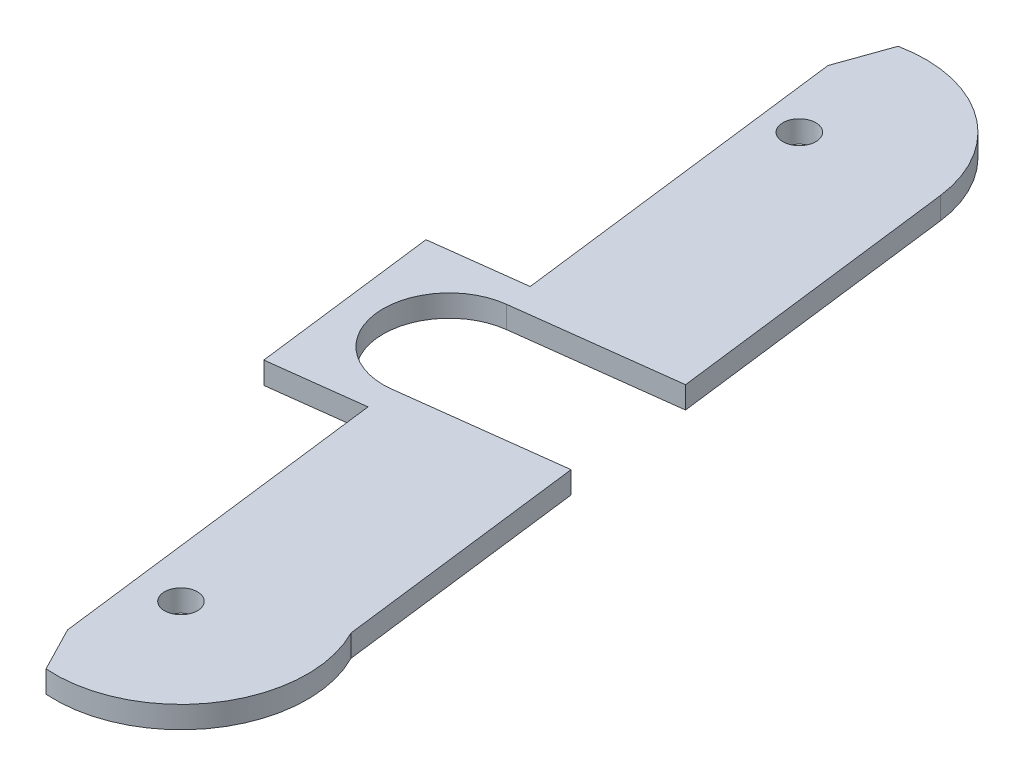
ISO-10303-21;
HEADER;
FILE_DESCRIPTION(('STEP AP214'),'2;1');
FILE_NAME('part.step','',(''),(''),'','','');
FILE_SCHEMA(('AUTOMOTIVE_DESIGN { 1 0 10303 214 1 1 1 1 }'));
ENDSEC;
DATA;
#1=APPLICATION_CONTEXT('core data for automotive mechanical design processes');
#2=APPLICATION_PROTOCOL_DEFINITION('international standard','automotive_design',2000,#1);
#3=PRODUCT_CONTEXT('',#1,'mechanical');
#4=PRODUCT('Part','Part','',(#3));
#5=PRODUCT_RELATED_PRODUCT_CATEGORY('part','',(#4));
#6=PRODUCT_DEFINITION_FORMATION('','',#4);
#7=PRODUCT_DEFINITION_CONTEXT('part definition',#1,'design');
#8=PRODUCT_DEFINITION('design','',#6,#7);
#9=PRODUCT_DEFINITION_SHAPE('','',#8);
#10=(LENGTH_UNIT() NAMED_UNIT(*) SI_UNIT(.MILLI.,.METRE.));
#11=(NAMED_UNIT(*) PLANE_ANGLE_UNIT() SI_UNIT($,.RADIAN.));
#12=(NAMED_UNIT(*) SI_UNIT($,.STERADIAN.) SOLID_ANGLE_UNIT());
#13=UNCERTAINTY_MEASURE_WITH_UNIT(LENGTH_MEASURE(1.E-05),#10,'distance_accuracy_value','');
#14=(GEOMETRIC_REPRESENTATION_CONTEXT(3) GLOBAL_UNCERTAINTY_ASSIGNED_CONTEXT((#13)) GLOBAL_UNIT_ASSIGNED_CONTEXT((#10,
#11,#12)) REPRESENTATION_CONTEXT('',''));
#15=CARTESIAN_POINT('',(0.,0.,0.));
#16=DIRECTION('',(0.,0.,1.));
#17=DIRECTION('',(1.,0.,0.));
#18=AXIS2_PLACEMENT_3D('',#15,#16,#17);
#19=CARTESIAN_POINT('',(148.082521914135,0.5,-18.4981847448383));
#20=DIRECTION('',(-0.992287877839178,0.,0.123954699359969));
#21=DIRECTION('',(0.123954699359969,0.,0.992287877839178));
#22=AXIS2_PLACEMENT_3D('',#19,#20,#21);
#23=PLANE('',#22);
#24=DIRECTION('',(0.,-1.,0.));
#25=VECTOR('',#24,1.);
#26=CARTESIAN_POINT('',(131.681948261951,0.5,-149.788813568923));
#27=LINE('',#26,#25);
#28=CARTESIAN_POINT('',(131.681948261951,0.,-149.788813568923));
#29=VERTEX_POINT('',#28);
#30=CARTESIAN_POINT('',(131.681948261951,-2.,-149.788813568923));
#31=VERTEX_POINT('',#30);
#32=EDGE_CURVE('E299',#29,#31,#27,.T.);
#33=ORIENTED_EDGE('',*,*,#32,.T.);
#34=DIRECTION('',(0.123954699359971,0.,0.992287877839178));
#35=VECTOR('',#34,1.);
#36=CARTESIAN_POINT('',(128.822601630398,-2.,-172.678587136854));
#37=LINE('',#36,#35);
#38=CARTESIAN_POINT('',(128.822601630398,-2.,-172.678587136854));
#39=VERTEX_POINT('',#38);
#40=EDGE_CURVE('E302',#39,#31,#37,.T.);
#41=ORIENTED_EDGE('',*,*,#40,.F.);
#42=DIRECTION('',(0.,-1.,0.));
#43=VECTOR('',#42,1.);
#44=CARTESIAN_POINT('',(128.822601630398,0.5,-172.678587136854));
#45=LINE('',#44,#43);
#46=CARTESIAN_POINT('',(128.822601630398,0.,-172.678587136854));
#47=VERTEX_POINT('',#46);
#48=EDGE_CURVE('E307',#47,#39,#45,.T.);
#49=ORIENTED_EDGE('',*,*,#48,.F.);
#50=DIRECTION('',(0.123954699359969,0.,0.992287877839178));
#51=VECTOR('',#50,1.);
#52=CARTESIAN_POINT('',(148.082521914135,0.,-18.4981847448383));
#53=LINE('',#52,#51);
#54=EDGE_CURVE('E303',#47,#29,#53,.T.);
#55=ORIENTED_EDGE('',*,*,#54,.T.);
#56=EDGE_LOOP('',(#33,#41,#49,#55));
#57=FACE_BOUND('',#56,.T.);
#58=ADVANCED_FACE('F58',(#57),#23,.F.);
#59=CARTESIAN_POINT('',(121.445927004418,-2.,-144.547261430927));
#60=DIRECTION('',(0.,-1.,0.));
#61=DIRECTION('',(0.,0.,-1.));
#62=AXIS2_PLACEMENT_3D('',#59,#60,#61);
#63=PLANE('',#62);
#64=CARTESIAN_POINT('',(112.612655684747,-2.,-209.66736518215));
#65=DIRECTION('',(0.,-1.,0.));
#66=DIRECTION('',(0.,0.,-1.));
#67=AXIS2_PLACEMENT_3D('',#64,#65,#66);
#68=CIRCLE('',#67,1.5);
#69=CARTESIAN_POINT('',(112.612655684747,-2.,-211.16736518215));
#70=VERTEX_POINT('',#69);
#71=EDGE_CURVE('E358',#70,#70,#68,.T.);
#72=ORIENTED_EDGE('',*,*,#71,.F.);
#73=EDGE_LOOP('',(#72));
#74=FACE_BOUND('',#73,.T.);
#75=DIRECTION('',(0.12395469935997,0.,0.992287877839178));
#76=VECTOR('',#75,1.);
#77=CARTESIAN_POINT('',(127.335145238078,-2.,-184.586041670924));
#78=LINE('',#77,#76);
#79=CARTESIAN_POINT('',(124.023966279898,-2.,-211.092844224789));
#80=VERTEX_POINT('',#79);
#81=CARTESIAN_POINT('',(127.335145238078,-2.,-184.586041670924));
#82=VERTEX_POINT('',#81);
#83=EDGE_CURVE('E448',#80,#82,#78,.T.);
#84=ORIENTED_EDGE('',*,*,#83,.T.);
#85=DIRECTION('',(-0.992287877839178,0.,0.123954699359972));
#86=VECTOR('',#85,1.);
#87=CARTESIAN_POINT('',(112.836894693598,-2.,-182.774948007863));
#88=LINE('',#87,#86);
#89=CARTESIAN_POINT('',(112.836894693598,-2.,-182.774948007863));
#90=VERTEX_POINT('',#89);
#91=EDGE_CURVE('E451',#82,#90,#88,.T.);
#92=ORIENTED_EDGE('',*,*,#91,.T.);
#93=CARTESIAN_POINT('',(113.580622889757,-2.,-176.821220740828));
#94=DIRECTION('',(0.,1.,0.));
#95=DIRECTION('',(0.,0.,-1.));
#96=AXIS2_PLACEMENT_3D('',#93,#94,#95);
#97=CIRCLE('',#96,6.);
#98=CARTESIAN_POINT('',(114.324351085917,-2.,-170.867493473793));
#99=VERTEX_POINT('',#98);
#100=EDGE_CURVE('E455',#90,#99,#97,.T.);
#101=ORIENTED_EDGE('',*,*,#100,.T.);
#102=DIRECTION('',(0.992287877839178,0.,-0.123954699359972));
#103=VECTOR('',#102,1.);
#104=CARTESIAN_POINT('',(114.324351085917,-2.,-170.867493473793));
#105=LINE('',#104,#103);
#106=EDGE_CURVE('E321',#99,#39,#105,.T.);
#107=ORIENTED_EDGE('',*,*,#106,.T.);
#108=ORIENTED_EDGE('',*,*,#40,.T.);
#109=CARTESIAN_POINT('',(121.445927004418,-2.,-144.547261430927));
#110=DIRECTION('',(0.,-1.,0.));
#111=DIRECTION('',(0.,0.,-1.));
#112=AXIS2_PLACEMENT_3D('',#109,#110,#111);
#113=CIRCLE('',#112,11.5);
#114=CARTESIAN_POINT('',(120.631460869528,-2.,-133.076139214024));
#115=VERTEX_POINT('',#114);
#116=EDGE_CURVE('E310',#31,#115,#113,.T.);
#117=ORIENTED_EDGE('',*,*,#116,.T.);
#118=DIRECTION('',(-0.458727163426408,0.,-0.888577171400865));
#119=VECTOR('',#118,1.);
#120=CARTESIAN_POINT('',(118.538810864156,-2.,-137.129705627261));
#121=LINE('',#120,#119);
#122=CARTESIAN_POINT('',(118.538810864156,-2.,-137.129705627261));
#123=VERTEX_POINT('',#122);
#124=EDGE_CURVE('E345',#115,#123,#121,.T.);
#125=ORIENTED_EDGE('',*,*,#124,.T.);
#126=DIRECTION('',(-0.12395469935997,0.,-0.992287877839178));
#127=VECTOR('',#126,1.);
#128=CARTESIAN_POINT('',(118.538810864156,-2.,-137.129705627261));
#129=LINE('',#128,#127);
#130=CARTESIAN_POINT('',(115.833096089085,-2.,-158.789618370032));
#131=VERTEX_POINT('',#130);
#132=EDGE_CURVE('E185',#123,#131,#129,.T.);
#133=ORIENTED_EDGE('',*,*,#132,.T.);
#134=CARTESIAN_POINT('',(110.61809447203,-2.,-151.023652522067));
#135=CARTESIAN_POINT('',(110.769477895981,-2.,-151.22609198635));
#136=CARTESIAN_POINT('',(110.920642807159,-2.,-151.42869534191));
#137=CARTESIAN_POINT('',(111.222424413877,-2.,-151.834312743935));
#138=CARTESIAN_POINT('',(111.373041104371,-2.,-152.037326794153));
#139=CARTESIAN_POINT('',(111.67366211356,-2.,-152.443912157412));
#140=CARTESIAN_POINT('',(111.823666212708,-2.,-152.647483632872));
#141=CARTESIAN_POINT('',(112.122854599724,-2.,-153.055227265973));
#142=CARTESIAN_POINT('',(112.272038890795,-2.,-153.259399421263));
#143=CARTESIAN_POINT('',(112.568287633103,-2.,-153.666986147654));
#144=CARTESIAN_POINT('',(112.715359605554,-2.,-153.870395247936));
#145=CARTESIAN_POINT('',(113.008214079542,-2.,-154.278139322133));
#146=CARTESIAN_POINT('',(113.153996586842,-2.,-154.482474291904));
#147=CARTESIAN_POINT('',(113.44386294313,-2.,-154.892305004981));
#148=CARTESIAN_POINT('',(113.587947022133,-2.,-155.0978005854));
#149=CARTESIAN_POINT('',(113.873875540399,-2.,-155.510341857317));
#150=CARTESIAN_POINT('',(114.015720031034,-2.,-155.717387513098));
#151=CARTESIAN_POINT('',(114.25445629168,-2.,-156.071481760564));
#152=CARTESIAN_POINT('',(114.352133409947,-2.,-156.218000247751));
#153=CARTESIAN_POINT('',(114.545537709365,-2.,-156.512334987788));
#154=CARTESIAN_POINT('',(114.641264767679,-2.,-156.660151321557));
#155=CARTESIAN_POINT('',(114.830600424634,-2.,-156.958102690159));
#156=CARTESIAN_POINT('',(114.924197147357,-2.,-157.108245296705));
#157=CARTESIAN_POINT('',(115.107912398806,-2.,-157.410623218255));
#158=CARTESIAN_POINT('',(115.198031456639,-2.,-157.562858210096));
#159=CARTESIAN_POINT('',(115.374180750863,-2.,-157.8713010418));
#160=CARTESIAN_POINT('',(115.460172810899,-2.,-158.027530836993));
#161=CARTESIAN_POINT('',(115.62525759895,-2.,-158.343802972618));
#162=CARTESIAN_POINT('',(115.704344888546,-2.,-158.503848194131));
#163=CARTESIAN_POINT('',(115.851861245576,-2.,-158.828095217572));
#164=CARTESIAN_POINT('',(115.920330579928,-2.,-158.992278426864));
#165=CARTESIAN_POINT('',(116.041433350349,-2.,-159.326378830032));
#166=CARTESIAN_POINT('',(116.094095049279,-2.,-159.496285178862));
#167=CARTESIAN_POINT('',(116.155370781992,-2.,-159.757254270692));
#168=CARTESIAN_POINT('',(116.17292789028,-2.,-159.846199950424));
#169=CARTESIAN_POINT('',(116.200385938386,-2.,-160.025291745369));
#170=CARTESIAN_POINT('',(116.210288098526,-2.,-160.115437666913));
#171=CARTESIAN_POINT('',(116.221165070415,-2.,-160.295643674074));
#172=CARTESIAN_POINT('',(116.222203909337,-2.,-160.385699668087));
#173=CARTESIAN_POINT('',(116.214719157441,-2.,-160.565419764603));
#174=CARTESIAN_POINT('',(116.206196904515,-2.,-160.655083920173));
#175=CARTESIAN_POINT('',(116.179467860638,-2.,-160.833216349507));
#176=CARTESIAN_POINT('',(116.161233148022,-2.,-160.921680417484));
#177=CARTESIAN_POINT('',(116.115747703086,-2.,-161.096250317771));
#178=CARTESIAN_POINT('',(116.088495097011,-2.,-161.182355655952));
#179=CARTESIAN_POINT('',(116.025943654075,-2.,-161.352324753043));
#180=CARTESIAN_POINT('',(115.990583188966,-2.,-161.436165541237));
#181=CARTESIAN_POINT('',(115.913345544544,-2.,-161.600755173976));
#182=CARTESIAN_POINT('',(115.871468027378,-2.,-161.68150385795));
#183=CARTESIAN_POINT('',(115.774303722463,-2.,-161.854673830258));
#184=CARTESIAN_POINT('',(115.717968211556,-2.,-161.946502086846));
#185=CARTESIAN_POINT('',(115.599755346094,-2.,-162.126546222944));
#186=CARTESIAN_POINT('',(115.537874894188,-2.,-162.214760042868));
#187=CARTESIAN_POINT('',(115.4098098426,-2.,-162.388255935728));
#188=CARTESIAN_POINT('',(115.343616872197,-2.,-162.47353178426));
#189=CARTESIAN_POINT('',(115.208041687414,-2.,-162.641466119183));
#190=CARTESIAN_POINT('',(115.138660083172,-2.,-162.724125101234));
#191=CARTESIAN_POINT('',(114.996655964994,-2.,-162.888165623529));
#192=CARTESIAN_POINT('',(114.924006588177,-2.,-162.969523807259));
#193=CARTESIAN_POINT('',(114.77671786099,-2.,-163.13041710947));
#194=CARTESIAN_POINT('',(114.702078440872,-2.,-163.209952163869));
#195=CARTESIAN_POINT('',(114.551313644104,-2.,-163.367401548165));
#196=CARTESIAN_POINT('',(114.475190298422,-2.,-163.4453178279));
#197=CARTESIAN_POINT('',(114.321668960799,-2.,-163.599878304691));
#198=CARTESIAN_POINT('',(114.244270994366,-2.,-163.676522527143));
#199=CARTESIAN_POINT('',(114.054608554606,-2.,-163.86178238976));
#200=CARTESIAN_POINT('',(113.941793467886,-2.,-163.969833933346));
#201=CARTESIAN_POINT('',(113.714519744946,-2.,-164.18419704448));
#202=CARTESIAN_POINT('',(113.600061045943,-2.,-164.290508545229));
#203=CARTESIAN_POINT('',(113.254749471096,-2.,-164.607387607216));
#204=CARTESIAN_POINT('',(113.021988049696,-2.,-164.815873790936));
#205=CARTESIAN_POINT('',(112.552959500352,-2.,-165.229363946907));
#206=CARTESIAN_POINT('',(112.316688802266,-2.,-165.43436384237));
#207=CARTESIAN_POINT('',(111.841923792118,-2.,-165.841732524409));
#208=CARTESIAN_POINT('',(111.60342964723,-2.,-166.044101506097));
#209=CARTESIAN_POINT('',(111.140567099088,-2.,-166.433704197922));
#210=CARTESIAN_POINT('',(110.916300169375,-2.,-166.621058720349));
#211=CARTESIAN_POINT('',(110.46670871308,-2.,-166.994504231567));
#212=CARTESIAN_POINT('',(110.241384162053,-2.,-167.180595190906));
#213=CARTESIAN_POINT('',(109.79035893753,-2.,-167.551436325022));
#214=CARTESIAN_POINT('',(109.564659813949,-2.,-167.736188386647));
#215=CARTESIAN_POINT('',(109.112625155505,-2.,-168.104896113401));
#216=CARTESIAN_POINT('',(108.886289643528,-2.,-168.288851806581));
#217=CARTESIAN_POINT('',(108.659712656904,-2.,-168.472508214606));
#218=B_SPLINE_CURVE_WITH_KNOTS('',3,(#134,#135,#136,#137,#138,#139,#140,#141,#142,#143,#144,
#145,#146,#147,#148,#149,#150,#151,#152,#153,#154,#155,#156,#157,#158,#159,#160,#161,#162,#163,
#164,#165,#166,#167,#168,#169,#170,#171,#172,#173,#174,#175,#176,#177,#178,#179,#180,#181,#182,
#183,#184,#185,#186,#187,#188,#189,#190,#191,#192,#193,#194,#195,#196,#197,#198,#199,#200,#201,
#202,#203,#204,#205,#206,#207,#208,#209,#210,#211,#212,#213,#214,#215,#216,#217),.UNSPECIFIED.,
.F.,.F.,(4,2,2,2,2,2,2,2,2,2,2,2,2,2,2,2,2,2,2,2,2,2,2,2,2,2,2,2,2,2,2,2,2,2,2,2,2,2,2,2,2,4),
(0.,0.758346070901993,1.51669910616378,2.27530352981149,3.03390498751677,3.78692762418871,
4.53994689379841,5.29286298358536,6.0457617775771,6.57402692452105,7.10232524540027,
7.63307228723693,8.16373825794707,8.69862056970993,9.23392044117186,9.76713782598633,
10.2993961006254,10.571115740755,10.8427920554293,11.1125041484924,11.3821785052315,
11.6526323476142,11.9231424206848,12.1957811364715,12.4684339909555,12.7913600175237,
13.1144675655626,13.4382221209099,13.7619149823554,14.089095138823,14.4162867778124,
14.7430583134413,15.0698233175122,15.5384354631126,16.0070655567313,16.9444378826637,
17.8828399114905,18.8211719455855,19.6978513582115,20.574551135013,21.4495696815341,
22.3245571519648),.UNSPECIFIED.);
#219=CARTESIAN_POINT('',(115.378670655035,-2.,-162.42740581914));
#220=VERTEX_POINT('',#219);
#221=EDGE_CURVE('E210',#131,#220,#218,.T.);
#222=ORIENTED_EDGE('',*,*,#221,.T.);
#223=DIRECTION('',(0.12395469935997,0.,0.992287877839178));
#224=VECTOR('',#223,1.);
#225=CARTESIAN_POINT('',(118.538810864156,-2.,-137.129705627261));
#226=LINE('',#225,#224);
#227=CARTESIAN_POINT('',(114.634237834317,-2.,-168.386773779195));
#228=VERTEX_POINT('',#227);
#229=EDGE_CURVE('E219',#228,#220,#226,.T.);
#230=ORIENTED_EDGE('',*,*,#229,.F.);
#231=DIRECTION('',(0.992287877839179,0.,-0.123954699359963));
#232=VECTOR('',#231,1.);
#233=CARTESIAN_POINT('',(106.199790872684,-2.,-167.333158834636));
#234=LINE('',#233,#232);
#235=CARTESIAN_POINT('',(106.199790872684,-2.,-167.333158834636));
#236=VERTEX_POINT('',#235);
#237=EDGE_CURVE('E394',#236,#228,#234,.T.);
#238=ORIENTED_EDGE('',*,*,#237,.F.);
#239=DIRECTION('',(0.123954699359969,0.,0.992287877839178));
#240=VECTOR('',#239,1.);
#241=CARTESIAN_POINT('',(104.092560983565,-2.,-184.202052757902));
#242=LINE('',#241,#240);
#243=CARTESIAN_POINT('',(104.092560983565,-2.,-184.202052757902));
#244=VERTEX_POINT('',#243);
#245=EDGE_CURVE('E391',#244,#236,#242,.T.);
#246=ORIENTED_EDGE('',*,*,#245,.F.);
#247=DIRECTION('',(-0.992287877839179,0.,0.123954699359966));
#248=VECTOR('',#247,1.);
#249=CARTESIAN_POINT('',(112.527007945198,-2.,-185.255667702461));
#250=LINE('',#249,#248);
#251=CARTESIAN_POINT('',(112.527007945198,-2.,-185.255667702461));
#252=VERTEX_POINT('',#251);
#253=EDGE_CURVE('E481',#252,#244,#250,.T.);
#254=ORIENTED_EDGE('',*,*,#253,.F.);
#255=DIRECTION('',(0.123954699359969,0.,0.992287877839178));
#256=VECTOR('',#255,1.);
#257=CARTESIAN_POINT('',(112.527007945198,-2.,-185.255667702461));
#258=LINE('',#257,#256);
#259=CARTESIAN_POINT('',(111.556658961166,-2.,-193.023550155484));
#260=VERTEX_POINT('',#259);
#261=EDGE_CURVE('E77',#260,#252,#258,.T.);
#262=ORIENTED_EDGE('',*,*,#261,.F.);
#263=CARTESIAN_POINT('',(106.341657344111,-2.,-185.257584307519));
#264=CARTESIAN_POINT('',(106.493040768063,-2.,-185.460023771802));
#265=CARTESIAN_POINT('',(106.64420567924,-2.,-185.662627127362));
#266=CARTESIAN_POINT('',(106.945987285958,-2.,-186.068244529386));
#267=CARTESIAN_POINT('',(107.096603976452,-2.,-186.271258579605));
#268=CARTESIAN_POINT('',(107.397224985641,-2.,-186.677843942864));
#269=CARTESIAN_POINT('',(107.54722908479,-2.,-186.881415418323));
#270=CARTESIAN_POINT('',(107.846417471805,-2.,-187.289159051425));
#271=CARTESIAN_POINT('',(107.995601762876,-2.,-187.493331206714));
#272=CARTESIAN_POINT('',(108.291850505184,-2.,-187.900917933106));
#273=CARTESIAN_POINT('',(108.438922477635,-2.,-188.104327033388));
#274=CARTESIAN_POINT('',(108.731776951623,-2.,-188.512071107585));
#275=CARTESIAN_POINT('',(108.877559458923,-2.,-188.716406077356));
#276=CARTESIAN_POINT('',(109.167425815211,-2.,-189.126236790433));
#277=CARTESIAN_POINT('',(109.311509894214,-2.,-189.331732370851));
#278=CARTESIAN_POINT('',(109.59743841248,-2.,-189.744273642768));
#279=CARTESIAN_POINT('',(109.739282903115,-2.,-189.95131929855));
#280=CARTESIAN_POINT('',(109.978019163761,-2.,-190.305413546015));
#281=CARTESIAN_POINT('',(110.075696282028,-2.,-190.451932033202));
#282=CARTESIAN_POINT('',(110.269100581446,-2.,-190.746266773239));
#283=CARTESIAN_POINT('',(110.364827639761,-2.,-190.894083107009));
#284=CARTESIAN_POINT('',(110.554163296715,-2.,-191.192034475611));
#285=CARTESIAN_POINT('',(110.647760019438,-2.,-191.342177082157));
#286=CARTESIAN_POINT('',(110.831475270887,-2.,-191.644555003706));
#287=CARTESIAN_POINT('',(110.92159432872,-2.,-191.796789995548));
#288=CARTESIAN_POINT('',(111.097743622944,-2.,-192.105232827252));
#289=CARTESIAN_POINT('',(111.18373568298,-2.,-192.261462622444));
#290=CARTESIAN_POINT('',(111.348820471031,-2.,-192.57773475807));
#291=CARTESIAN_POINT('',(111.427907760627,-2.,-192.737779979583));
#292=CARTESIAN_POINT('',(111.575424117657,-2.,-193.062027003023));
#293=CARTESIAN_POINT('',(111.64389345201,-2.,-193.226210212315));
#294=CARTESIAN_POINT('',(111.76499622243,-2.,-193.560310615484));
#295=CARTESIAN_POINT('',(111.81765792136,-2.,-193.730216964314));
#296=CARTESIAN_POINT('',(111.878933654073,-2.,-193.991186056144));
#297=CARTESIAN_POINT('',(111.896490762362,-2.,-194.080131735875));
#298=CARTESIAN_POINT('',(111.923948810467,-2.,-194.259223530821));
#299=CARTESIAN_POINT('',(111.933850970607,-2.,-194.349369452365));
#300=CARTESIAN_POINT('',(111.944727942496,-2.,-194.529575459526));
#301=CARTESIAN_POINT('',(111.945766781418,-2.,-194.619631453539));
#302=CARTESIAN_POINT('',(111.938282029523,-2.,-194.799351550055));
#303=CARTESIAN_POINT('',(111.929759776596,-2.,-194.889015705624));
#304=CARTESIAN_POINT('',(111.903030732719,-2.,-195.067148134959));
#305=CARTESIAN_POINT('',(111.884796020103,-2.,-195.155612202935));
#306=CARTESIAN_POINT('',(111.839310575167,-2.,-195.330182103223));
#307=CARTESIAN_POINT('',(111.812057969093,-2.,-195.416287441403));
#308=CARTESIAN_POINT('',(111.749506526156,-2.,-195.586256538494));
#309=CARTESIAN_POINT('',(111.714146061047,-2.,-195.670097326689));
#310=CARTESIAN_POINT('',(111.636908416625,-2.,-195.834686959428));
#311=CARTESIAN_POINT('',(111.595030899459,-2.,-195.915435643402));
#312=CARTESIAN_POINT('',(111.497866594544,-2.,-196.08860561571));
#313=CARTESIAN_POINT('',(111.441531083637,-2.,-196.180433872298));
#314=CARTESIAN_POINT('',(111.323318218175,-2.,-196.360478008395));
#315=CARTESIAN_POINT('',(111.26143776627,-2.,-196.44869182832));
#316=CARTESIAN_POINT('',(111.133372714681,-2.,-196.622187721179));
#317=CARTESIAN_POINT('',(111.067179744278,-2.,-196.707463569712));
#318=CARTESIAN_POINT('',(110.931604559495,-2.,-196.875397904634));
#319=CARTESIAN_POINT('',(110.862222955253,-2.,-196.958056886686));
#320=CARTESIAN_POINT('',(110.720218837075,-2.,-197.12209740898));
#321=CARTESIAN_POINT('',(110.647569460258,-2.,-197.203455592711));
#322=CARTESIAN_POINT('',(110.500280733072,-2.,-197.364348894921));
#323=CARTESIAN_POINT('',(110.425641312953,-2.,-197.44388394932));
#324=CARTESIAN_POINT('',(110.274876516185,-2.,-197.601333333616));
#325=CARTESIAN_POINT('',(110.198753170503,-2.,-197.679249613351));
#326=CARTESIAN_POINT('',(110.04523183288,-2.,-197.833810090143));
#327=CARTESIAN_POINT('',(109.967833866447,-2.,-197.910454312594));
#328=CARTESIAN_POINT('',(109.778171426687,-2.,-198.095714175211));
#329=CARTESIAN_POINT('',(109.665356339967,-2.,-198.203765718797));
#330=CARTESIAN_POINT('',(109.438082617027,-2.,-198.418128829932));
#331=CARTESIAN_POINT('',(109.323623918025,-2.,-198.524440330681));
#332=CARTESIAN_POINT('',(108.978312343177,-2.,-198.841319392668));
#333=CARTESIAN_POINT('',(108.745550921777,-2.,-199.049805576387));
#334=CARTESIAN_POINT('',(108.276522372433,-2.,-199.463295732358));
#335=CARTESIAN_POINT('',(108.040251674347,-2.,-199.668295627822));
#336=CARTESIAN_POINT('',(107.565486664199,-2.,-200.075664309861));
#337=CARTESIAN_POINT('',(107.32699251931,-2.,-200.278033291549));
#338=CARTESIAN_POINT('',(106.864129971169,-2.,-200.667635983373));
#339=CARTESIAN_POINT('',(106.639863041456,-2.,-200.854990505801));
#340=CARTESIAN_POINT('',(106.190271585161,-2.,-201.228436017019));
#341=CARTESIAN_POINT('',(105.964947034133,-2.,-201.414526976358));
#342=CARTESIAN_POINT('',(105.513921809611,-2.,-201.785368110474));
#343=CARTESIAN_POINT('',(105.28822268603,-2.,-201.970120172099));
#344=CARTESIAN_POINT('',(104.836188027586,-2.,-202.338827898852));
#345=CARTESIAN_POINT('',(104.609852515609,-2.,-202.522783592033));
#346=CARTESIAN_POINT('',(104.383275528985,-2.,-202.706440000057));
#347=B_SPLINE_CURVE_WITH_KNOTS('',3,(#263,#264,#265,#266,#267,#268,#269,#270,#271,#272,#273,
#274,#275,#276,#277,#278,#279,#280,#281,#282,#283,#284,#285,#286,#287,#288,#289,#290,#291,#292,
#293,#294,#295,#296,#297,#298,#299,#300,#301,#302,#303,#304,#305,#306,#307,#308,#309,#310,#311,
#312,#313,#314,#315,#316,#317,#318,#319,#320,#321,#322,#323,#324,#325,#326,#327,#328,#329,#330,
#331,#332,#333,#334,#335,#336,#337,#338,#339,#340,#341,#342,#343,#344,#345,#346),.UNSPECIFIED.,
.F.,.F.,(4,2,2,2,2,2,2,2,2,2,2,2,2,2,2,2,2,2,2,2,2,2,2,2,2,2,2,2,2,2,2,2,2,2,2,2,2,2,2,2,2,4),
(0.,0.758346070902016,1.51669910616378,2.27530352981151,3.0339049875168,3.78692762418878,
4.53994689379844,5.29286298358535,6.04576177757719,6.57402692452117,7.10232524540035,
7.63307228723704,8.16373825794717,8.69862056971007,9.23392044117199,9.76713782598649,
10.2993961006255,10.5711157407551,10.8427920554294,11.1125041484925,11.3821785052316,
11.6526323476144,11.923142420685,12.1957811364716,12.4684339909556,12.7913600175239,
13.1144675655628,13.43822212091,13.7619149823555,14.0890951388231,14.4162867778125,
14.7430583134413,15.0698233175123,15.5384354631127,16.0070655567314,16.9444378826638,
17.8828399114907,18.8211719455857,19.6978513582118,20.5745511350133,21.4495696815345,
22.3245571519652),.UNSPECIFIED.);
#348=CARTESIAN_POINT('',(111.102233527116,-2.,-196.661337604592));
#349=VERTEX_POINT('',#348);
#350=EDGE_CURVE('E12',#260,#349,#347,.T.);
#351=ORIENTED_EDGE('',*,*,#350,.T.);
#352=DIRECTION('',(-0.123954699359969,0.,-0.992287877839178));
#353=VECTOR('',#352,1.);
#354=CARTESIAN_POINT('',(112.527007945198,-2.,-185.255667702461));
#355=LINE('',#354,#353);
#356=CARTESIAN_POINT('',(108.658032839898,-2.,-216.227765706603));
#357=VERTEX_POINT('',#356);
#358=EDGE_CURVE('E176',#349,#357,#355,.T.);
#359=ORIENTED_EDGE('',*,*,#358,.T.);
#360=DIRECTION('',(0.33489172938772,0.,-0.942256615571205));
#361=VECTOR('',#360,1.);
#362=CARTESIAN_POINT('',(108.658032839898,-2.,-216.227765706603));
#363=LINE('',#362,#361);
#364=CARTESIAN_POINT('',(110.332491486836,-2.,-220.939048784459));
#365=VERTEX_POINT('',#364);
#366=EDGE_CURVE('E184',#357,#365,#363,.T.);
#367=ORIENTED_EDGE('',*,*,#366,.T.);
#368=CARTESIAN_POINT('',(112.612655684747,-2.,-209.66736518215));
#369=DIRECTION('',(0.,-1.,0.));
#370=DIRECTION('',(0.,0.,-1.));
#371=AXIS2_PLACEMENT_3D('',#368,#369,#370);
#372=CIRCLE('',#371,11.5);
#373=EDGE_CURVE('E444',#365,#80,#372,.T.);
#374=ORIENTED_EDGE('',*,*,#373,.T.);
#375=EDGE_LOOP('',(#84,#92,#101,#107,#108,#117,#125,#133,#222,#230,#238,#246,#254,#262,#351,
#359,#367,#374));
#376=FACE_BOUND('',#375,.T.);
#377=CARTESIAN_POINT('',(121.445927004418,-2.,-144.547261430927));
#378=DIRECTION('',(0.,-1.,0.));
#379=DIRECTION('',(0.,0.,-1.));
#380=AXIS2_PLACEMENT_3D('',#377,#378,#379);
#381=CIRCLE('',#380,1.5);
#382=CARTESIAN_POINT('',(121.445927004418,-2.,-146.047261430927));
#383=VERTEX_POINT('',#382);
#384=EDGE_CURVE('E431',#383,#383,#381,.T.);
#385=ORIENTED_EDGE('',*,*,#384,.F.);
#386=EDGE_LOOP('',(#385));
#387=FACE_BOUND('',#386,.T.);
#388=ADVANCED_FACE('F187',(#74,#376,#387),#63,.T.);
#389=CARTESIAN_POINT('',(28.2402409955532,0.5,10.0369930961891));
#390=DIRECTION('',(-0.942256615571206,0.,-0.334891729387717));
#391=DIRECTION('',(-0.334891729387717,0.,0.942256615571206));
#392=AXIS2_PLACEMENT_3D('',#389,#390,#391);
#393=PLANE('',#392);
#394=DIRECTION('',(-0.334891729387717,0.,0.942256615571206));
#395=VECTOR('',#394,1.);
#396=CARTESIAN_POINT('',(28.2402409955532,0.,10.0369930961891));
#397=LINE('',#396,#395);
#398=CARTESIAN_POINT('',(110.332491486836,0.,-220.939048784459));
#399=VERTEX_POINT('',#398);
#400=CARTESIAN_POINT('',(108.658032839898,0.,-216.227765706603));
#401=VERTEX_POINT('',#400);
#402=EDGE_CURVE('E85',#399,#401,#397,.T.);
#403=ORIENTED_EDGE('',*,*,#402,.F.);
#404=DIRECTION('',(0.,-1.,0.));
#405=VECTOR('',#404,1.);
#406=CARTESIAN_POINT('',(110.332491486836,0.5,-220.939048784459));
#407=LINE('',#406,#405);
#408=EDGE_CURVE('E306',#399,#365,#407,.T.);
#409=ORIENTED_EDGE('',*,*,#408,.T.);
#410=ORIENTED_EDGE('',*,*,#366,.F.);
#411=DIRECTION('',(0.,1.,0.));
#412=VECTOR('',#411,1.);
#413=CARTESIAN_POINT('',(108.658032839898,-2.,-216.227765706603));
#414=LINE('',#413,#412);
#415=EDGE_CURVE('E180',#357,#401,#414,.T.);
#416=ORIENTED_EDGE('',*,*,#415,.T.);
#417=EDGE_LOOP('',(#403,#409,#410,#416));
#418=FACE_BOUND('',#417,.T.);
#419=ADVANCED_FACE('F228',(#418),#393,.T.);
#420=CARTESIAN_POINT('',(-20.747376676057,0.5,-166.087856926086));
#421=DIRECTION('',(-0.12395469935997,0.,-0.992287877839178));
#422=DIRECTION('',(-0.992287877839178,0.,0.12395469935997));
#423=AXIS2_PLACEMENT_3D('',#420,#421,#422);
#424=PLANE('',#423);
#425=DIRECTION('',(0.,-1.,0.));
#426=VECTOR('',#425,1.);
#427=CARTESIAN_POINT('',(127.335145238078,0.5,-184.586041670924));
#428=LINE('',#427,#426);
#429=CARTESIAN_POINT('',(127.335145238078,0.,-184.586041670924));
#430=VERTEX_POINT('',#429);
#431=EDGE_CURVE('E366',#430,#82,#428,.T.);
#432=ORIENTED_EDGE('',*,*,#431,.F.);
#433=DIRECTION('',(-0.992287877839178,0.,0.12395469935997));
#434=VECTOR('',#433,1.);
#435=CARTESIAN_POINT('',(-20.747376676057,0.,-166.087856926086));
#436=LINE('',#435,#434);
#437=CARTESIAN_POINT('',(112.836894693598,0.,-182.774948007863));
#438=VERTEX_POINT('',#437);
#439=EDGE_CURVE('E423',#430,#438,#436,.T.);
#440=ORIENTED_EDGE('',*,*,#439,.T.);
#441=DIRECTION('',(0.,-1.,0.));
#442=VECTOR('',#441,1.);
#443=CARTESIAN_POINT('',(112.836894693598,0.5,-182.774948007863));
#444=LINE('',#443,#442);
#445=EDGE_CURVE('E63',#438,#90,#444,.T.);
#446=ORIENTED_EDGE('',*,*,#445,.T.);
#447=ORIENTED_EDGE('',*,*,#91,.F.);
#448=EDGE_LOOP('',(#432,#440,#446,#447));
#449=FACE_BOUND('',#448,.T.);
#450=ADVANCED_FACE('F231',(#449),#424,.F.);
#451=ORIENTED_EDGE('',*,*,#431,.T.);
#452=ORIENTED_EDGE('',*,*,#83,.F.);
#453=DIRECTION('',(0.,-1.,0.));
#454=VECTOR('',#453,1.);
#455=CARTESIAN_POINT('',(124.023966279898,0.5,-211.092844224789));
#456=LINE('',#455,#454);
#457=CARTESIAN_POINT('',(124.023966279898,0.,-211.092844224789));
#458=VERTEX_POINT('',#457);
#459=EDGE_CURVE('E363',#458,#80,#456,.T.);
#460=ORIENTED_EDGE('',*,*,#459,.F.);
#461=EDGE_CURVE('E412',#458,#430,#53,.T.);
#462=ORIENTED_EDGE('',*,*,#461,.T.);
#463=EDGE_LOOP('',(#451,#452,#460,#462));
#464=FACE_BOUND('',#463,.T.);
#465=ADVANCED_FACE('F237',(#464),#23,.F.);
#466=CARTESIAN_POINT('',(112.612655684747,0.5,-209.66736518215));
#467=DIRECTION('',(0.,-1.,0.));
#468=DIRECTION('',(0.,0.,-1.));
#469=AXIS2_PLACEMENT_3D('',#466,#467,#468);
#470=CYLINDRICAL_SURFACE('',#469,11.5);
#471=CARTESIAN_POINT('',(112.612655684747,0.,-209.66736518215));
#472=DIRECTION('',(0.,-1.,0.));
#473=DIRECTION('',(0.,0.,-1.));
#474=AXIS2_PLACEMENT_3D('',#471,#472,#473);
#475=CIRCLE('',#474,11.5);
#476=EDGE_CURVE('E420',#458,#399,#475,.F.);
#477=ORIENTED_EDGE('',*,*,#476,.F.);
#478=ORIENTED_EDGE('',*,*,#459,.T.);
#479=ORIENTED_EDGE('',*,*,#373,.F.);
#480=ORIENTED_EDGE('',*,*,#408,.F.);
#481=EDGE_LOOP('',(#477,#478,#479,#480));
#482=FACE_BOUND('',#481,.T.);
#483=ADVANCED_FACE('F233',(#482),#470,.T.);
#484=CARTESIAN_POINT('',(121.445927004418,0.5,-144.547261430927));
#485=DIRECTION('',(0.,-1.,0.));
#486=DIRECTION('',(0.,0.,-1.));
#487=AXIS2_PLACEMENT_3D('',#484,#485,#486);
#488=CYLINDRICAL_SURFACE('',#487,11.5);
#489=ORIENTED_EDGE('',*,*,#32,.F.);
#490=CARTESIAN_POINT('',(121.445927004418,0.,-144.547261430927));
#491=DIRECTION('',(0.,-1.,0.));
#492=DIRECTION('',(0.,0.,-1.));
#493=AXIS2_PLACEMENT_3D('',#490,#491,#492);
#494=CIRCLE('',#493,11.5);
#495=CARTESIAN_POINT('',(120.631460869528,0.,-133.076139214024));
#496=VERTEX_POINT('',#495);
#497=EDGE_CURVE('E400',#29,#496,#494,.T.);
#498=ORIENTED_EDGE('',*,*,#497,.T.);
#499=DIRECTION('',(0.,-1.,0.));
#500=VECTOR('',#499,1.);
#501=CARTESIAN_POINT('',(120.631460869528,0.5,-133.076139214024));
#502=LINE('',#501,#500);
#503=EDGE_CURVE('E312',#496,#115,#502,.T.);
#504=ORIENTED_EDGE('',*,*,#503,.T.);
#505=ORIENTED_EDGE('',*,*,#116,.F.);
#506=EDGE_LOOP('',(#489,#498,#504,#505));
#507=FACE_BOUND('',#506,.T.);
#508=ADVANCED_FACE('F236',(#507),#488,.T.);
#509=CARTESIAN_POINT('',(-19.2599202837373,0.5,-154.180402392016));
#510=DIRECTION('',(-0.12395469935997,0.,-0.992287877839178));
#511=DIRECTION('',(-0.992287877839178,0.,0.12395469935997));
#512=AXIS2_PLACEMENT_3D('',#509,#510,#511);
#513=PLANE('',#512);
#514=DIRECTION('',(-0.992287877839178,0.,0.12395469935997));
#515=VECTOR('',#514,1.);
#516=CARTESIAN_POINT('',(-19.2599202837373,0.,-154.180402392016));
#517=LINE('',#516,#515);
#518=CARTESIAN_POINT('',(114.324351085917,0.,-170.867493473793));
#519=VERTEX_POINT('',#518);
#520=EDGE_CURVE('E415',#47,#519,#517,.T.);
#521=ORIENTED_EDGE('',*,*,#520,.F.);
#522=ORIENTED_EDGE('',*,*,#48,.T.);
#523=ORIENTED_EDGE('',*,*,#106,.F.);
#524=DIRECTION('',(0.,-1.,0.));
#525=VECTOR('',#524,1.);
#526=CARTESIAN_POINT('',(114.324351085917,0.5,-170.867493473793));
#527=LINE('',#526,#525);
#528=EDGE_CURVE('E202',#519,#99,#527,.T.);
#529=ORIENTED_EDGE('',*,*,#528,.F.);
#530=EDGE_LOOP('',(#521,#522,#523,#529));
#531=FACE_BOUND('',#530,.T.);
#532=ADVANCED_FACE('F247',(#531),#513,.T.);
#533=CARTESIAN_POINT('',(149.490670911827,0.5,-77.1744240491592));
#534=DIRECTION('',(0.888577171400865,0.,-0.458727163426408));
#535=DIRECTION('',(-0.458727163426408,0.,-0.888577171400865));
#536=AXIS2_PLACEMENT_3D('',#533,#534,#535);
#537=PLANE('',#536);
#538=ORIENTED_EDGE('',*,*,#503,.F.);
#539=DIRECTION('',(-0.458727163426408,0.,-0.888577171400865));
#540=VECTOR('',#539,1.);
#541=CARTESIAN_POINT('',(149.490670911827,0.,-77.1744240491592));
#542=LINE('',#541,#540);
#543=CARTESIAN_POINT('',(118.538810864156,0.,-137.129705627261));
#544=VERTEX_POINT('',#543);
#545=EDGE_CURVE('E398',#496,#544,#542,.T.);
#546=ORIENTED_EDGE('',*,*,#545,.T.);
#547=DIRECTION('',(0.,1.,0.));
#548=VECTOR('',#547,1.);
#549=CARTESIAN_POINT('',(118.538810864156,-2.,-137.129705627261));
#550=LINE('',#549,#548);
#551=EDGE_CURVE('E349',#123,#544,#550,.T.);
#552=ORIENTED_EDGE('',*,*,#551,.F.);
#553=ORIENTED_EDGE('',*,*,#124,.F.);
#554=EDGE_LOOP('',(#538,#546,#552,#553));
#555=FACE_BOUND('',#554,.T.);
#556=ADVANCED_FACE('F249',(#555),#537,.F.);
#557=CARTESIAN_POINT('',(113.580622889757,-0.00110000000015512,-176.821220740828));
#558=DIRECTION('',(0.,1.,0.));
#559=DIRECTION('',(0.,0.,1.));
#560=AXIS2_PLACEMENT_3D('',#557,#558,#559);
#561=CYLINDRICAL_SURFACE('',#560,6.);
#562=ORIENTED_EDGE('',*,*,#445,.F.);
#563=CARTESIAN_POINT('',(113.580622889757,0.,-176.821220740828));
#564=DIRECTION('',(0.,-1.,0.));
#565=DIRECTION('',(0.,0.,-1.));
#566=AXIS2_PLACEMENT_3D('',#563,#564,#565);
#567=CIRCLE('',#566,6.);
#568=EDGE_CURVE('E427',#438,#519,#567,.F.);
#569=ORIENTED_EDGE('',*,*,#568,.T.);
#570=ORIENTED_EDGE('',*,*,#528,.T.);
#571=ORIENTED_EDGE('',*,*,#100,.F.);
#572=EDGE_LOOP('',(#562,#569,#570,#571));
#573=FACE_BOUND('',#572,.T.);
#574=ADVANCED_FACE('F252',(#573),#561,.F.);
#575=CARTESIAN_POINT('',(118.538810864156,-2.,-137.129705627261));
#576=DIRECTION('',(0.992287877839178,0.,-0.12395469935997));
#577=DIRECTION('',(-0.12395469935997,0.,-0.992287877839178));
#578=AXIS2_PLACEMENT_3D('',#575,#576,#577);
#579=PLANE('',#578);
#580=DIRECTION('',(0.,1.,0.));
#581=VECTOR('',#580,1.);
#582=CARTESIAN_POINT('',(114.634237834317,-2.,-168.386773779195));
#583=LINE('',#582,#581);
#584=CARTESIAN_POINT('',(114.634237834317,0.,-168.386773779195));
#585=VERTEX_POINT('',#584);
#586=EDGE_CURVE('E353',#228,#585,#583,.T.);
#587=ORIENTED_EDGE('',*,*,#586,.F.);
#588=ORIENTED_EDGE('',*,*,#229,.T.);
#589=CARTESIAN_POINT('',(115.60588337206,-4.5,-160.608512094586));
#590=DIRECTION('',(0.992287877839178,0.,-0.12395469935997));
#591=DIRECTION('',(-0.12395469935997,0.,-0.992287877839178));
#592=AXIS2_PLACEMENT_3D('',#589,#590,#591);
#593=CIRCLE('',#592,3.10000000000003);
#594=EDGE_CURVE('E191',#220,#131,#593,.T.);
#595=ORIENTED_EDGE('',*,*,#594,.T.);
#596=ORIENTED_EDGE('',*,*,#132,.F.);
#597=ORIENTED_EDGE('',*,*,#551,.T.);
#598=DIRECTION('',(-0.12395469935997,0.,-0.992287877839178));
#599=VECTOR('',#598,1.);
#600=CARTESIAN_POINT('',(118.538810864156,0.,-137.129705627261));
#601=LINE('',#600,#599);
#602=EDGE_CURVE('E330',#544,#585,#601,.T.);
#603=ORIENTED_EDGE('',*,*,#602,.T.);
#604=EDGE_LOOP('',(#587,#588,#595,#596,#597,#603));
#605=FACE_BOUND('',#604,.T.);
#606=ADVANCED_FACE('F259',(#605),#579,.F.);
#607=CARTESIAN_POINT('',(106.199790872684,-2.,-167.333158834636));
#608=DIRECTION('',(-0.123954699359963,0.,-0.992287877839179));
#609=DIRECTION('',(-0.992287877839179,0.,0.123954699359963));
#610=AXIS2_PLACEMENT_3D('',#607,#608,#609);
#611=PLANE('',#610);
#612=DIRECTION('',(0.,1.,0.));
#613=VECTOR('',#612,1.);
#614=CARTESIAN_POINT('',(106.199790872684,-2.,-167.333158834636));
#615=LINE('',#614,#613);
#616=CARTESIAN_POINT('',(106.199790872684,0.,-167.333158834636));
#617=VERTEX_POINT('',#616);
#618=EDGE_CURVE('E378',#236,#617,#615,.T.);
#619=ORIENTED_EDGE('',*,*,#618,.F.);
#620=ORIENTED_EDGE('',*,*,#237,.T.);
#621=ORIENTED_EDGE('',*,*,#586,.T.);
#622=DIRECTION('',(-0.992287877839179,0.,0.123954699359963));
#623=VECTOR('',#622,1.);
#624=CARTESIAN_POINT('',(106.199790872684,0.,-167.333158834636));
#625=LINE('',#624,#623);
#626=EDGE_CURVE('E325',#585,#617,#625,.T.);
#627=ORIENTED_EDGE('',*,*,#626,.T.);
#628=EDGE_LOOP('',(#619,#620,#621,#627));
#629=FACE_BOUND('',#628,.T.);
#630=ADVANCED_FACE('F263',(#629),#611,.F.);
#631=CARTESIAN_POINT('',(104.092560983565,-2.,-184.202052757902));
#632=DIRECTION('',(0.992287877839178,0.,-0.123954699359969));
#633=DIRECTION('',(-0.123954699359969,0.,-0.992287877839178));
#634=AXIS2_PLACEMENT_3D('',#631,#632,#633);
#635=PLANE('',#634);
#636=DIRECTION('',(0.,1.,0.));
#637=VECTOR('',#636,1.);
#638=CARTESIAN_POINT('',(104.092560983565,-2.,-184.202052757902));
#639=LINE('',#638,#637);
#640=CARTESIAN_POINT('',(104.092560983565,0.,-184.202052757902));
#641=VERTEX_POINT('',#640);
#642=EDGE_CURVE('E381',#244,#641,#639,.T.);
#643=ORIENTED_EDGE('',*,*,#642,.F.);
#644=ORIENTED_EDGE('',*,*,#245,.T.);
#645=ORIENTED_EDGE('',*,*,#618,.T.);
#646=DIRECTION('',(-0.123954699359969,0.,-0.992287877839178));
#647=VECTOR('',#646,1.);
#648=CARTESIAN_POINT('',(104.092560983565,0.,-184.202052757902));
#649=LINE('',#648,#647);
#650=EDGE_CURVE('E329',#617,#641,#649,.T.);
#651=ORIENTED_EDGE('',*,*,#650,.T.);
#652=EDGE_LOOP('',(#643,#644,#645,#651));
#653=FACE_BOUND('',#652,.T.);
#654=ADVANCED_FACE('F267',(#653),#635,.F.);
#655=CARTESIAN_POINT('',(112.527007945198,-2.,-185.255667702461));
#656=DIRECTION('',(0.123954699359966,0.,0.992287877839178));
#657=DIRECTION('',(0.992287877839179,0.,-0.123954699359966));
#658=AXIS2_PLACEMENT_3D('',#655,#656,#657);
#659=PLANE('',#658);
#660=DIRECTION('',(0.,1.,0.));
#661=VECTOR('',#660,1.);
#662=CARTESIAN_POINT('',(112.527007945198,-2.,-185.255667702461));
#663=LINE('',#662,#661);
#664=CARTESIAN_POINT('',(112.527007945198,0.,-185.255667702461));
#665=VERTEX_POINT('',#664);
#666=EDGE_CURVE('E319',#252,#665,#663,.T.);
#667=ORIENTED_EDGE('',*,*,#666,.F.);
#668=ORIENTED_EDGE('',*,*,#253,.T.);
#669=ORIENTED_EDGE('',*,*,#642,.T.);
#670=DIRECTION('',(0.992287877839179,0.,-0.123954699359966));
#671=VECTOR('',#670,1.);
#672=CARTESIAN_POINT('',(112.527007945198,0.,-185.255667702461));
#673=LINE('',#672,#671);
#674=EDGE_CURVE('E334',#641,#665,#673,.T.);
#675=ORIENTED_EDGE('',*,*,#674,.T.);
#676=EDGE_LOOP('',(#667,#668,#669,#675));
#677=FACE_BOUND('',#676,.T.);
#678=ADVANCED_FACE('F271',(#677),#659,.F.);
#679=CARTESIAN_POINT('',(112.527007945198,-2.,-185.255667702461));
#680=DIRECTION('',(0.992287877839178,0.,-0.123954699359969));
#681=DIRECTION('',(-0.123954699359969,0.,-0.992287877839178));
#682=AXIS2_PLACEMENT_3D('',#679,#680,#681);
#683=PLANE('',#682);
#684=ORIENTED_EDGE('',*,*,#358,.F.);
#685=CARTESIAN_POINT('',(111.329446244141,-4.5,-194.842443880038));
#686=DIRECTION('',(0.992287877839178,0.,-0.123954699359969));
#687=DIRECTION('',(-0.123954699359969,0.,-0.992287877839178));
#688=AXIS2_PLACEMENT_3D('',#685,#686,#687);
#689=CIRCLE('',#688,3.10000000000007);
#690=EDGE_CURVE('E70',#349,#260,#689,.T.);
#691=ORIENTED_EDGE('',*,*,#690,.T.);
#692=ORIENTED_EDGE('',*,*,#261,.T.);
#693=ORIENTED_EDGE('',*,*,#666,.T.);
#694=DIRECTION('',(-0.123954699359969,0.,-0.992287877839178));
#695=VECTOR('',#694,1.);
#696=CARTESIAN_POINT('',(112.527007945198,0.,-185.255667702461));
#697=LINE('',#696,#695);
#698=EDGE_CURVE('E338',#665,#401,#697,.T.);
#699=ORIENTED_EDGE('',*,*,#698,.T.);
#700=ORIENTED_EDGE('',*,*,#415,.F.);
#701=EDGE_LOOP('',(#684,#691,#692,#693,#699,#700));
#702=FACE_BOUND('',#701,.T.);
#703=ADVANCED_FACE('F177',(#702),#683,.F.);
#704=CARTESIAN_POINT('',(121.445927004418,12.501025,-144.547261430927));
#705=DIRECTION('',(0.,-1.,0.));
#706=DIRECTION('',(0.,0.,-1.));
#707=AXIS2_PLACEMENT_3D('',#704,#705,#706);
#708=CYLINDRICAL_SURFACE('',#707,1.5);
#709=CARTESIAN_POINT('',(121.445927004418,0.,-144.547261430927));
#710=DIRECTION('',(0.,-1.,0.));
#711=DIRECTION('',(0.,0.,-1.));
#712=AXIS2_PLACEMENT_3D('',#709,#710,#711);
#713=CIRCLE('',#712,1.5);
#714=CARTESIAN_POINT('',(121.445927004418,0.,-146.047261430927));
#715=VERTEX_POINT('',#714);
#716=EDGE_CURVE('E401',#715,#715,#713,.F.);
#717=ORIENTED_EDGE('',*,*,#716,.T.);
#718=EDGE_LOOP('',(#717));
#719=FACE_BOUND('',#718,.T.);
#720=ORIENTED_EDGE('',*,*,#384,.T.);
#721=EDGE_LOOP('',(#720));
#722=FACE_BOUND('',#721,.T.);
#723=ADVANCED_FACE('F278',(#719,#722),#708,.F.);
#724=CARTESIAN_POINT('',(112.612655684747,12.501025,-209.66736518215));
#725=DIRECTION('',(0.,-1.,0.));
#726=DIRECTION('',(0.,0.,-1.));
#727=AXIS2_PLACEMENT_3D('',#724,#725,#726);
#728=CYLINDRICAL_SURFACE('',#727,1.5);
#729=CARTESIAN_POINT('',(112.612655684747,0.,-209.66736518215));
#730=DIRECTION('',(0.,-1.,0.));
#731=DIRECTION('',(0.,0.,-1.));
#732=AXIS2_PLACEMENT_3D('',#729,#730,#731);
#733=CIRCLE('',#732,1.5);
#734=CARTESIAN_POINT('',(112.612655684747,0.,-211.16736518215));
#735=VERTEX_POINT('',#734);
#736=EDGE_CURVE('E218',#735,#735,#733,.F.);
#737=ORIENTED_EDGE('',*,*,#736,.T.);
#738=EDGE_LOOP('',(#737));
#739=FACE_BOUND('',#738,.T.);
#740=ORIENTED_EDGE('',*,*,#71,.T.);
#741=EDGE_LOOP('',(#740));
#742=FACE_BOUND('',#741,.T.);
#743=ADVANCED_FACE('F226',(#739,#742),#728,.F.);
#744=CARTESIAN_POINT('',(117.094315188819,-4.5,-160.794444143626));
#745=DIRECTION('',(-0.992287877839181,0.,0.123954699359944));
#746=DIRECTION('',(0.123954699359944,0.,0.992287877839181));
#747=AXIS2_PLACEMENT_3D('',#744,#745,#746);
#748=CONICAL_SURFACE('',#747,1.59999999999997,0.785398163397465);
#749=ORIENTED_EDGE('',*,*,#221,.F.);
#750=ORIENTED_EDGE('',*,*,#594,.F.);
#751=EDGE_LOOP('',(#749,#750));
#752=FACE_BOUND('',#751,.T.);
#753=ADVANCED_FACE('F222',(#752),#748,.F.);
#754=CARTESIAN_POINT('',(112.8178780609,-4.5,-195.028375929078));
#755=DIRECTION('',(-0.992287877839179,0.,0.123954699359959));
#756=DIRECTION('',(0.123954699359959,0.,0.99228787783918));
#757=AXIS2_PLACEMENT_3D('',#754,#755,#756);
#758=CONICAL_SURFACE('',#757,1.6,0.785398163397463);
#759=ORIENTED_EDGE('',*,*,#350,.F.);
#760=ORIENTED_EDGE('',*,*,#690,.F.);
#761=EDGE_LOOP('',(#759,#760));
#762=FACE_BOUND('',#761,.T.);
#763=ADVANCED_FACE('F60',(#762),#758,.F.);
#764=CARTESIAN_POINT('',(101.631640458694,0.,-122.940127677044));
#765=DIRECTION('',(0.,-1.,0.));
#766=DIRECTION('',(0.,0.,-1.));
#767=AXIS2_PLACEMENT_3D('',#764,#765,#766);
#768=PLANE('',#767);
#769=ORIENTED_EDGE('',*,*,#716,.F.);
#770=EDGE_LOOP('',(#769));
#771=FACE_BOUND('',#770,.T.);
#772=ORIENTED_EDGE('',*,*,#736,.F.);
#773=EDGE_LOOP('',(#772));
#774=FACE_BOUND('',#773,.T.);
#775=ORIENTED_EDGE('',*,*,#439,.F.);
#776=ORIENTED_EDGE('',*,*,#461,.F.);
#777=ORIENTED_EDGE('',*,*,#476,.T.);
#778=ORIENTED_EDGE('',*,*,#402,.T.);
#779=ORIENTED_EDGE('',*,*,#698,.F.);
#780=ORIENTED_EDGE('',*,*,#674,.F.);
#781=ORIENTED_EDGE('',*,*,#650,.F.);
#782=ORIENTED_EDGE('',*,*,#626,.F.);
#783=ORIENTED_EDGE('',*,*,#602,.F.);
#784=ORIENTED_EDGE('',*,*,#545,.F.);
#785=ORIENTED_EDGE('',*,*,#497,.F.);
#786=ORIENTED_EDGE('',*,*,#54,.F.);
#787=ORIENTED_EDGE('',*,*,#520,.T.);
#788=ORIENTED_EDGE('',*,*,#568,.F.);
#789=EDGE_LOOP('',(#775,#776,#777,#778,#779,#780,#781,#782,#783,#784,#785,#786,#787,#788));
#790=FACE_BOUND('',#789,.T.);
#791=ADVANCED_FACE('F206',(#771,#774,#790),#768,.F.);
#792=CLOSED_SHELL('',(#58,#388,#419,#450,#465,#483,#508,#532,#556,#574,#606,#630,#654,#678,#703,
#723,#743,#753,#763,#791));
#793=MANIFOLD_SOLID_BREP('B2',#792);
#794=ADVANCED_BREP_SHAPE_REPRESENTATION('',(#18,#793),#14);
#795=SHAPE_DEFINITION_REPRESENTATION(#9,#794);
ENDSEC;
END-ISO-10303-21;
